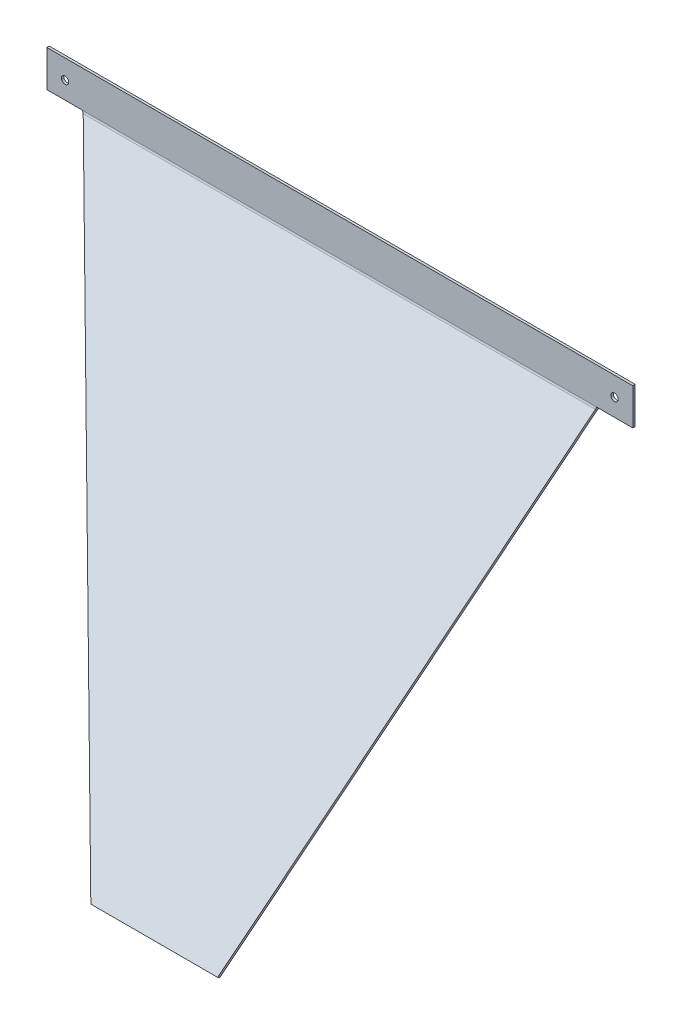
ISO-10303-21;
HEADER;
FILE_DESCRIPTION(('STEP AP214'),'2;1');
FILE_NAME('part.step','',(''),(''),'','','');
FILE_SCHEMA(('AUTOMOTIVE_DESIGN { 1 0 10303 214 1 1 1 1 }'));
ENDSEC;
DATA;
#1=APPLICATION_CONTEXT('core data for automotive mechanical design processes');
#2=APPLICATION_PROTOCOL_DEFINITION('international standard','automotive_design',2000,#1);
#3=PRODUCT_CONTEXT('',#1,'mechanical');
#4=PRODUCT('Part','Part','',(#3));
#5=PRODUCT_RELATED_PRODUCT_CATEGORY('part','',(#4));
#6=PRODUCT_DEFINITION_FORMATION('','',#4);
#7=PRODUCT_DEFINITION_CONTEXT('part definition',#1,'design');
#8=PRODUCT_DEFINITION('design','',#6,#7);
#9=PRODUCT_DEFINITION_SHAPE('','',#8);
#10=(LENGTH_UNIT() NAMED_UNIT(*) SI_UNIT(.MILLI.,.METRE.));
#11=(NAMED_UNIT(*) PLANE_ANGLE_UNIT() SI_UNIT($,.RADIAN.));
#12=(NAMED_UNIT(*) SI_UNIT($,.STERADIAN.) SOLID_ANGLE_UNIT());
#13=UNCERTAINTY_MEASURE_WITH_UNIT(LENGTH_MEASURE(1.E-05),#10,'distance_accuracy_value','');
#14=(GEOMETRIC_REPRESENTATION_CONTEXT(3) GLOBAL_UNCERTAINTY_ASSIGNED_CONTEXT((#13)) GLOBAL_UNIT_ASSIGNED_CONTEXT((#10,
#11,#12)) REPRESENTATION_CONTEXT('',''));
#15=CARTESIAN_POINT('',(0.,0.,0.));
#16=DIRECTION('',(0.,0.,1.));
#17=DIRECTION('',(1.,0.,0.));
#18=AXIS2_PLACEMENT_3D('',#15,#16,#17);
#19=CARTESIAN_POINT('',(-211.563590388948,1.0035352311325,-211.429668547693));
#20=DIRECTION('',(0.843991716803207,0.420919678305727,-0.332422331353624));
#21=DIRECTION('',(-0.536356208100154,0.662344756272809,-0.523088369083407));
#22=AXIS2_PLACEMENT_3D('',#19,#20,#21);
#23=PLANE('',#22);
#24=CARTESIAN_POINT('',(-210.036566425682,-2.12174038265548,-211.509971304452));
#25=CARTESIAN_POINT('',(-210.036566425682,-0.882182319065202,-209.940418563386));
#26=B_SPLINE_CURVE_WITH_KNOTS('',1,(#24,#25),.UNSPECIFIED.,.F.,.F.,(2,2),(0.,1.),.UNSPECIFIED.);
#27=CARTESIAN_POINT('',(-210.036566425682,-2.12174038265545,-211.509971304452));
#28=VERTEX_POINT('',#27);
#29=CARTESIAN_POINT('',(-210.036566425682,-0.882182319065228,-209.940418563386));
#30=VERTEX_POINT('',#29);
#31=EDGE_CURVE('E11',#28,#30,#26,.T.);
#32=ORIENTED_EDGE('',*,*,#31,.F.);
#33=DIRECTION('',(-0.536356208100154,0.662344756272809,-0.523088369083407));
#34=VECTOR('',#33,1.);
#35=CARTESIAN_POINT('',(-211.563590388948,-0.236022832457776,-212.999221288759));
#36=LINE('',#35,#34);
#37=CARTESIAN_POINT('',(42.7639640091258,-314.304396587156,35.0370345313996));
#38=VERTEX_POINT('',#37);
#39=EDGE_CURVE('E108',#38,#28,#36,.T.);
#40=ORIENTED_EDGE('',*,*,#39,.F.);
#41=DIRECTION('',(0.,0.619779031795136,0.784776370533086));
#42=VECTOR('',#41,1.);
#43=CARTESIAN_POINT('',(42.7639640091258,-313.064838523566,36.6065872724657));
#44=LINE('',#43,#42);
#45=CARTESIAN_POINT('',(42.7639640091258,-313.064838523566,36.6065872724657));
#46=VERTEX_POINT('',#45);
#47=EDGE_CURVE('E55',#38,#46,#44,.T.);
#48=ORIENTED_EDGE('',*,*,#47,.T.);
#49=DIRECTION('',(-0.536356208100154,0.662344756272809,-0.523088369083407));
#50=VECTOR('',#49,1.);
#51=CARTESIAN_POINT('',(-211.563590388948,1.0035352311325,-211.429668547693));
#52=LINE('',#51,#50);
#53=EDGE_CURVE('E111',#46,#30,#52,.T.);
#54=ORIENTED_EDGE('',*,*,#53,.T.);
#55=EDGE_LOOP('',(#32,#40,#48,#54));
#56=FACE_BOUND('',#55,.T.);
#57=ADVANCED_FACE('F43',(#56),#23,.F.);
#58=CARTESIAN_POINT('',(42.7639640091258,-313.064838523566,36.6065872724657));
#59=DIRECTION('',(0.,0.784776370533086,-0.619779031795136));
#60=DIRECTION('',(-1.,0.,0.));
#61=AXIS2_PLACEMENT_3D('',#58,#59,#60);
#62=PLANE('',#61);
#63=ORIENTED_EDGE('',*,*,#47,.F.);
#64=DIRECTION('',(1.,0.,0.));
#65=VECTOR('',#64,1.);
#66=CARTESIAN_POINT('',(0.,-314.304396587156,35.0370345313996));
#67=LINE('',#66,#65);
#68=CARTESIAN_POINT('',(146.869286468248,-314.304396587156,35.0370345313996));
#69=VERTEX_POINT('',#68);
#70=EDGE_CURVE('E143',#69,#38,#67,.F.);
#71=ORIENTED_EDGE('',*,*,#70,.F.);
#72=DIRECTION('',(0.,0.619779031795136,0.784776370533086));
#73=VECTOR('',#72,1.);
#74=CARTESIAN_POINT('',(146.869286468248,-313.064838523566,36.6065872724657));
#75=LINE('',#74,#73);
#76=CARTESIAN_POINT('',(146.869286468248,-313.064838523566,36.6065872724657));
#77=VERTEX_POINT('',#76);
#78=EDGE_CURVE('E193',#69,#77,#75,.T.);
#79=ORIENTED_EDGE('',*,*,#78,.T.);
#80=DIRECTION('',(-1.,0.,0.));
#81=VECTOR('',#80,1.);
#82=CARTESIAN_POINT('',(42.7639640091258,-313.064838523566,36.6065872724657));
#83=LINE('',#82,#81);
#84=EDGE_CURVE('E282',#77,#46,#83,.T.);
#85=ORIENTED_EDGE('',*,*,#84,.T.);
#86=EDGE_LOOP('',(#63,#71,#79,#85));
#87=FACE_BOUND('',#86,.T.);
#88=ADVANCED_FACE('F426',(#87),#62,.F.);
#89=CARTESIAN_POINT('',(146.869286468248,-313.064838523566,36.6065872724657));
#90=DIRECTION('',(-0.987492255733326,0.12373373912849,-0.0977190189676004));
#91=DIRECTION('',(-0.157667513669454,-0.77496058838393,0.612026994163596));
#92=AXIS2_PLACEMENT_3D('',#89,#90,#91);
#93=PLANE('',#92);
#94=ORIENTED_EDGE('',*,*,#78,.F.);
#95=DIRECTION('',(-0.157667513669454,-0.77496058838393,0.612026994163596));
#96=VECTOR('',#95,1.);
#97=CARTESIAN_POINT('',(146.869286468248,-314.304396587156,35.0370345313995));
#98=LINE('',#97,#96);
#99=CARTESIAN_POINT('',(210.383565713252,-2.12174038265539,-211.509971304452));
#100=VERTEX_POINT('',#99);
#101=EDGE_CURVE('E138',#100,#69,#98,.T.);
#102=ORIENTED_EDGE('',*,*,#101,.F.);
#103=CARTESIAN_POINT('',(210.383565713252,-0.882182319065137,-209.940418563386));
#104=CARTESIAN_POINT('',(210.383565713252,-2.12174038265542,-211.509971304452));
#105=B_SPLINE_CURVE_WITH_KNOTS('',1,(#103,#104),.UNSPECIFIED.,.F.,.F.,(2,2),(0.,1.),.UNSPECIFIED.);
#106=CARTESIAN_POINT('',(210.383565713252,-0.882182319065117,-209.940418563386));
#107=VERTEX_POINT('',#106);
#108=EDGE_CURVE('E196',#100,#107,#105,.F.);
#109=ORIENTED_EDGE('',*,*,#108,.T.);
#110=DIRECTION('',(-0.157667513669454,-0.77496058838393,0.612026994163596));
#111=VECTOR('',#110,1.);
#112=CARTESIAN_POINT('',(146.869286468248,-313.064838523566,36.6065872724657));
#113=LINE('',#112,#111);
#114=EDGE_CURVE('E273',#107,#77,#113,.T.);
#115=ORIENTED_EDGE('',*,*,#114,.T.);
#116=EDGE_LOOP('',(#94,#102,#109,#115));
#117=FACE_BOUND('',#116,.T.);
#118=ADVANCED_FACE('F215',(#117),#93,.F.);
#119=CARTESIAN_POINT('',(210.767219284903,0.724659156541195,-212.499997715965));
#120=CARTESIAN_POINT('',(210.703271087254,0.212889063114862,-212.499487724902));
#121=CARTESIAN_POINT('',(210.63933476102,-0.298594913490471,-212.412805020948));
#122=CARTESIAN_POINT('',(210.511450237136,-1.2652387865455,-212.076589759642));
#123=CARTESIAN_POINT('',(210.447513910902,-1.7201151067701,-211.827155834949));
#124=CARTESIAN_POINT('',(210.383565713252,-2.12174038265542,-211.509971304452));
#125=CARTESIAN_POINT('',(210.767219284903,0.726652203089471,-210.499998709023));
#126=CARTESIAN_POINT('',(210.703271275476,0.437391697335336,-210.499710454054));
#127=CARTESIAN_POINT('',(210.63933476102,0.148291206984618,-210.450715881405));
#128=CARTESIAN_POINT('',(210.511450237136,-0.398072721263876,-210.260681168493));
#129=CARTESIAN_POINT('',(210.447513722679,-0.65517739650625,-210.119696248596));
#130=CARTESIAN_POINT('',(210.383565713252,-0.882182319065137,-209.940418563386));
#131=B_SPLINE_SURFACE_WITH_KNOTS('',1,3,((#119,#120,#121,#122,#123,#124),(#125,#126,#127,#128,
#129,#130)),.UNSPECIFIED.,.F.,.F.,.F.,(2,2),(4,2,4),(0.,1.),(0.,0.5,1.),.UNSPECIFIED.);
#132=CARTESIAN_POINT('',(210.383565713252,-2.12174038265542,-211.509971304452));
#133=CARTESIAN_POINT('',(210.447513910902,-1.7201151067701,-211.827155834949));
#134=CARTESIAN_POINT('',(210.511450237136,-1.2652387865455,-212.076589759642));
#135=CARTESIAN_POINT('',(210.63933476102,-0.298594913490471,-212.412805020948));
#136=CARTESIAN_POINT('',(210.703271087254,0.212889063114862,-212.499487724902));
#137=CARTESIAN_POINT('',(210.767219284903,0.724659156541195,-212.499997715965));
#138=B_SPLINE_CURVE_WITH_KNOTS('',3,(#132,#133,#134,#135,#136,#137),.UNSPECIFIED.,.F.,.F.,(4,2,
4),(0.,0.5,1.),.UNSPECIFIED.);
#139=CARTESIAN_POINT('',(210.767219284903,0.724659156541195,-212.499997715965));
#140=VERTEX_POINT('',#139);
#141=EDGE_CURVE('E132',#140,#100,#138,.F.);
#142=CARTESIAN_POINT('',(210.767219284903,0.724659156541195,-212.499997715965));
#143=CARTESIAN_POINT('',(210.767219284903,0.726652203089471,-210.499998709023));
#144=B_SPLINE_CURVE_WITH_KNOTS('',1,(#142,#143),.UNSPECIFIED.,.F.,.F.,(2,2),(0.,1.),.UNSPECIFIED.);
#145=CARTESIAN_POINT('',(210.767219284903,0.726652203089428,-210.499998709023));
#146=VERTEX_POINT('',#145);
#147=EDGE_CURVE('E252',#140,#146,#144,.T.);
#148=CARTESIAN_POINT('',(210.767219284903,0.726652203089471,-210.499998709023));
#149=CARTESIAN_POINT('',(210.703271275476,0.437391697335336,-210.499710454054));
#150=CARTESIAN_POINT('',(210.63933476102,0.148291206984618,-210.450715881405));
#151=CARTESIAN_POINT('',(210.511450237136,-0.398072721263876,-210.260681168493));
#152=CARTESIAN_POINT('',(210.447513722679,-0.65517739650625,-210.119696248596));
#153=CARTESIAN_POINT('',(210.383565713252,-0.882182319065137,-209.940418563386));
#154=B_SPLINE_CURVE_WITH_KNOTS('',3,(#148,#149,#150,#151,#152,#153),.UNSPECIFIED.,.F.,.F.,(4,2,
4),(0.,0.5,1.),.UNSPECIFIED.);
#155=EDGE_CURVE('E287',#146,#107,#154,.T.);
#156=ORIENTED_EDGE('',*,*,#108,.F.);
#157=ORIENTED_EDGE('',*,*,#141,.F.);
#158=ORIENTED_EDGE('',*,*,#147,.T.);
#159=ORIENTED_EDGE('',*,*,#155,.T.);
#160=EDGE_LOOP('',(#156,#157,#158,#159));
#161=FACE_BOUND('',#160,.T.);
#162=ADVANCED_FACE('F202',(#161),#131,.T.);
#163=CARTESIAN_POINT('',(225.633609642452,0.726652203089427,-210.499998709023));
#164=DIRECTION('',(0.,0.999999503470559,-0.00099652327415575));
#165=DIRECTION('',(1.,0.,0.));
#166=AXIS2_PLACEMENT_3D('',#163,#164,#165);
#167=PLANE('',#166);
#168=ORIENTED_EDGE('',*,*,#147,.F.);
#169=DIRECTION('',(1.,0.,0.));
#170=VECTOR('',#169,1.);
#171=CARTESIAN_POINT('',(-480.84641141443,0.724659156541006,-212.499997715964));
#172=LINE('',#171,#170);
#173=CARTESIAN_POINT('',(240.5,0.724659156541118,-212.499997715965));
#174=VERTEX_POINT('',#173);
#175=EDGE_CURVE('E374',#174,#140,#172,.F.);
#176=ORIENTED_EDGE('',*,*,#175,.F.);
#177=DIRECTION('',(0.,0.00099652327415625,0.999999503470559));
#178=VECTOR('',#177,1.);
#179=CARTESIAN_POINT('',(240.5,0.726652203089428,-210.499998709023));
#180=LINE('',#179,#178);
#181=CARTESIAN_POINT('',(240.5,0.726652203089428,-210.499998709023));
#182=VERTEX_POINT('',#181);
#183=EDGE_CURVE('E487',#174,#182,#180,.T.);
#184=ORIENTED_EDGE('',*,*,#183,.T.);
#185=DIRECTION('',(1.,0.,0.));
#186=VECTOR('',#185,1.);
#187=CARTESIAN_POINT('',(-480.84641141443,0.726652203089317,-210.499998709023));
#188=LINE('',#187,#186);
#189=EDGE_CURVE('E292',#182,#146,#188,.F.);
#190=ORIENTED_EDGE('',*,*,#189,.T.);
#191=EDGE_LOOP('',(#168,#176,#184,#190));
#192=FACE_BOUND('',#191,.T.);
#193=ADVANCED_FACE('F214',(#192),#167,.F.);
#194=CARTESIAN_POINT('',(240.5,0.729243163602233,-207.9));
#195=DIRECTION('',(-1.,0.,0.));
#196=DIRECTION('',(0.,-1.,0.));
#197=AXIS2_PLACEMENT_3D('',#194,#195,#196);
#198=PLANE('',#197);
#199=ORIENTED_EDGE('',*,*,#183,.F.);
#200=CARTESIAN_POINT('',(240.5,0.729243163602235,-207.9));
#201=DIRECTION('',(1.,0.,0.));
#202=DIRECTION('',(0.,1.,0.));
#203=AXIS2_PLACEMENT_3D('',#200,#201,#202);
#204=CIRCLE('',#203,4.6);
#205=CARTESIAN_POINT('',(240.5,0.729243163602223,-212.5));
#206=VERTEX_POINT('',#205);
#207=EDGE_CURVE('E360',#206,#174,#204,.F.);
#208=ORIENTED_EDGE('',*,*,#207,.F.);
#209=DIRECTION('',(0.,0.,1.));
#210=VECTOR('',#209,1.);
#211=CARTESIAN_POINT('',(240.5,0.729243163602233,-210.5));
#212=LINE('',#211,#210);
#213=CARTESIAN_POINT('',(240.5,0.729243163602233,-210.5));
#214=VERTEX_POINT('',#213);
#215=EDGE_CURVE('E481',#206,#214,#212,.T.);
#216=ORIENTED_EDGE('',*,*,#215,.T.);
#217=CARTESIAN_POINT('',(240.5,0.729243163602233,-207.9));
#218=DIRECTION('',(1.,0.,0.));
#219=DIRECTION('',(0.,1.,0.));
#220=AXIS2_PLACEMENT_3D('',#217,#218,#219);
#221=CIRCLE('',#220,2.6);
#222=EDGE_CURVE('E342',#214,#182,#221,.F.);
#223=ORIENTED_EDGE('',*,*,#222,.T.);
#224=EDGE_LOOP('',(#199,#208,#216,#223));
#225=FACE_BOUND('',#224,.T.);
#226=ADVANCED_FACE('F483',(#225),#198,.F.);
#227=CARTESIAN_POINT('',(240.5,0.72565567922156,-210.5));
#228=DIRECTION('',(-1.,0.,0.));
#229=DIRECTION('',(0.,-1.,0.));
#230=AXIS2_PLACEMENT_3D('',#227,#228,#229);
#231=PLANE('',#230);
#232=ORIENTED_EDGE('',*,*,#215,.F.);
#233=DIRECTION('',(0.,-1.,0.));
#234=VECTOR('',#233,1.);
#235=CARTESIAN_POINT('',(240.5,-131.101570322424,-212.500000000001));
#236=LINE('',#235,#234);
#237=CARTESIAN_POINT('',(240.5,30.7256556792215,-212.5));
#238=VERTEX_POINT('',#237);
#239=EDGE_CURVE('E355',#238,#206,#236,.T.);
#240=ORIENTED_EDGE('',*,*,#239,.F.);
#241=DIRECTION('',(0.,0.,1.));
#242=VECTOR('',#241,1.);
#243=CARTESIAN_POINT('',(240.5,30.7256556792215,-210.5));
#244=LINE('',#243,#242);
#245=CARTESIAN_POINT('',(240.5,30.7256556792215,-210.5));
#246=VERTEX_POINT('',#245);
#247=EDGE_CURVE('E488',#238,#246,#244,.T.);
#248=ORIENTED_EDGE('',*,*,#247,.T.);
#249=DIRECTION('',(0.,-1.,0.));
#250=VECTOR('',#249,1.);
#251=CARTESIAN_POINT('',(240.5,0.72565567922156,-210.5));
#252=LINE('',#251,#250);
#253=EDGE_CURVE('E323',#246,#214,#252,.T.);
#254=ORIENTED_EDGE('',*,*,#253,.T.);
#255=EDGE_LOOP('',(#232,#240,#248,#254));
#256=FACE_BOUND('',#255,.T.);
#257=ADVANCED_FACE('F493',(#256),#231,.F.);
#258=CARTESIAN_POINT('',(240.5,30.7256556792215,-210.5));
#259=DIRECTION('',(0.,-1.,0.));
#260=DIRECTION('',(1.,0.,0.));
#261=AXIS2_PLACEMENT_3D('',#258,#259,#260);
#262=PLANE('',#261);
#263=ORIENTED_EDGE('',*,*,#247,.F.);
#264=DIRECTION('',(1.,0.,0.));
#265=VECTOR('',#264,1.);
#266=CARTESIAN_POINT('',(0.,30.7256556792216,-212.5));
#267=LINE('',#266,#265);
#268=CARTESIAN_POINT('',(-240.5,30.7256556792216,-212.5));
#269=VERTEX_POINT('',#268);
#270=EDGE_CURVE('E365',#269,#238,#267,.T.);
#271=ORIENTED_EDGE('',*,*,#270,.F.);
#272=DIRECTION('',(0.,0.,1.));
#273=VECTOR('',#272,1.);
#274=CARTESIAN_POINT('',(-240.5,30.7256556792216,-210.5));
#275=LINE('',#274,#273);
#276=CARTESIAN_POINT('',(-240.5,30.7256556792216,-210.5));
#277=VERTEX_POINT('',#276);
#278=EDGE_CURVE('E507',#269,#277,#275,.T.);
#279=ORIENTED_EDGE('',*,*,#278,.T.);
#280=DIRECTION('',(1.,0.,0.));
#281=VECTOR('',#280,1.);
#282=CARTESIAN_POINT('',(240.5,30.7256556792215,-210.5));
#283=LINE('',#282,#281);
#284=EDGE_CURVE('E327',#277,#246,#283,.T.);
#285=ORIENTED_EDGE('',*,*,#284,.T.);
#286=EDGE_LOOP('',(#263,#271,#279,#285));
#287=FACE_BOUND('',#286,.T.);
#288=ADVANCED_FACE('F506',(#287),#262,.F.);
#289=CARTESIAN_POINT('',(-240.5,30.7256556792216,-210.5));
#290=DIRECTION('',(1.,0.,0.));
#291=DIRECTION('',(0.,1.,0.));
#292=AXIS2_PLACEMENT_3D('',#289,#290,#291);
#293=PLANE('',#292);
#294=ORIENTED_EDGE('',*,*,#278,.F.);
#295=DIRECTION('',(0.,-1.,0.));
#296=VECTOR('',#295,1.);
#297=CARTESIAN_POINT('',(-240.5,-131.101570322424,-212.500000000001));
#298=LINE('',#297,#296);
#299=CARTESIAN_POINT('',(-240.5,0.729243163602094,-212.5));
#300=VERTEX_POINT('',#299);
#301=EDGE_CURVE('E361',#300,#269,#298,.F.);
#302=ORIENTED_EDGE('',*,*,#301,.F.);
#303=DIRECTION('',(0.,0.,1.));
#304=VECTOR('',#303,1.);
#305=CARTESIAN_POINT('',(-240.5,0.729243163602122,-210.5));
#306=LINE('',#305,#304);
#307=CARTESIAN_POINT('',(-240.5,0.729243163602122,-210.5));
#308=VERTEX_POINT('',#307);
#309=EDGE_CURVE('E500',#300,#308,#306,.T.);
#310=ORIENTED_EDGE('',*,*,#309,.T.);
#311=DIRECTION('',(0.,1.,0.));
#312=VECTOR('',#311,1.);
#313=CARTESIAN_POINT('',(-240.5,30.7256556792216,-210.5));
#314=LINE('',#313,#312);
#315=EDGE_CURVE('E331',#308,#277,#314,.T.);
#316=ORIENTED_EDGE('',*,*,#315,.T.);
#317=EDGE_LOOP('',(#294,#302,#310,#316));
#318=FACE_BOUND('',#317,.T.);
#319=ADVANCED_FACE('F559',(#318),#293,.F.);
#320=CARTESIAN_POINT('',(-240.5,0.729243163602122,-207.9));
#321=DIRECTION('',(-1.,0.,0.));
#322=DIRECTION('',(0.,-1.,0.));
#323=AXIS2_PLACEMENT_3D('',#320,#321,#322);
#324=PLANE('',#323);
#325=ORIENTED_EDGE('',*,*,#309,.F.);
#326=CARTESIAN_POINT('',(-240.5,0.72924316360216,-207.9));
#327=DIRECTION('',(1.,0.,0.));
#328=DIRECTION('',(0.,1.,0.));
#329=AXIS2_PLACEMENT_3D('',#326,#327,#328);
#330=CIRCLE('',#329,4.6);
#331=CARTESIAN_POINT('',(-240.5,0.724659156541239,-212.499997715965));
#332=VERTEX_POINT('',#331);
#333=EDGE_CURVE('E284',#332,#300,#330,.T.);
#334=ORIENTED_EDGE('',*,*,#333,.F.);
#335=DIRECTION('',(0.,0.000996523274127443,0.999999503470559));
#336=VECTOR('',#335,1.);
#337=CARTESIAN_POINT('',(-240.5,0.726652203089428,-210.499998709023));
#338=LINE('',#337,#336);
#339=CARTESIAN_POINT('',(-240.5,0.726652203089428,-210.499998709023));
#340=VERTEX_POINT('',#339);
#341=EDGE_CURVE('E63',#332,#340,#338,.T.);
#342=ORIENTED_EDGE('',*,*,#341,.T.);
#343=CARTESIAN_POINT('',(-240.5,0.729243163602122,-207.9));
#344=DIRECTION('',(1.,0.,0.));
#345=DIRECTION('',(0.,1.,0.));
#346=AXIS2_PLACEMENT_3D('',#343,#344,#345);
#347=CIRCLE('',#346,2.6);
#348=EDGE_CURVE('E348',#340,#308,#347,.T.);
#349=ORIENTED_EDGE('',*,*,#348,.T.);
#350=EDGE_LOOP('',(#325,#334,#342,#349));
#351=FACE_BOUND('',#350,.T.);
#352=ADVANCED_FACE('F499',(#351),#324,.T.);
#353=CARTESIAN_POINT('',(-226.031795194474,0.726652203089468,-210.499998709023));
#354=DIRECTION('',(0.,0.999999503470559,-0.000996523274113049));
#355=DIRECTION('',(1.,0.,0.));
#356=AXIS2_PLACEMENT_3D('',#353,#354,#355);
#357=PLANE('',#356);
#358=ORIENTED_EDGE('',*,*,#341,.F.);
#359=DIRECTION('',(1.,0.,0.));
#360=VECTOR('',#359,1.);
#361=CARTESIAN_POINT('',(-480.84641141443,0.724659156541202,-212.499997715964));
#362=LINE('',#361,#360);
#363=CARTESIAN_POINT('',(-211.563590388948,0.724659156541244,-212.499997715965));
#364=VERTEX_POINT('',#363);
#365=EDGE_CURVE('E152',#364,#332,#362,.F.);
#366=ORIENTED_EDGE('',*,*,#365,.F.);
#367=CARTESIAN_POINT('',(-211.563590388948,0.726652203089465,-210.499998709023));
#368=CARTESIAN_POINT('',(-211.563590388948,0.724659156541235,-212.499997715965));
#369=B_SPLINE_CURVE_WITH_KNOTS('',1,(#367,#368),.UNSPECIFIED.,.F.,.F.,(2,2),(0.,1.),.UNSPECIFIED.);
#370=CARTESIAN_POINT('',(-211.563590388948,0.726652203089428,-210.499998709023));
#371=VERTEX_POINT('',#370);
#372=EDGE_CURVE('E150',#364,#371,#369,.F.);
#373=ORIENTED_EDGE('',*,*,#372,.T.);
#374=DIRECTION('',(1.,0.,0.));
#375=VECTOR('',#374,1.);
#376=CARTESIAN_POINT('',(-480.84641141443,0.726652203089428,-210.499998709023));
#377=LINE('',#376,#375);
#378=EDGE_CURVE('E335',#371,#340,#377,.F.);
#379=ORIENTED_EDGE('',*,*,#378,.T.);
#380=EDGE_LOOP('',(#358,#366,#373,#379));
#381=FACE_BOUND('',#380,.T.);
#382=ADVANCED_FACE('F501',(#381),#357,.F.);
#383=CARTESIAN_POINT('',(-225.5,15.,-210.5));
#384=DIRECTION('',(0.,0.,1.));
#385=DIRECTION('',(0.,-1.,0.));
#386=AXIS2_PLACEMENT_3D('',#383,#384,#385);
#387=CYLINDRICAL_SURFACE('',#386,2.99999999999999);
#388=CARTESIAN_POINT('',(-225.5,15.,-210.5));
#389=DIRECTION('',(0.,0.,1.));
#390=DIRECTION('',(0.,-1.,0.));
#391=AXIS2_PLACEMENT_3D('',#388,#389,#390);
#392=CIRCLE('',#391,2.99999999999999);
#393=CARTESIAN_POINT('',(-225.5,12.,-210.5));
#394=VERTEX_POINT('',#393);
#395=EDGE_CURVE('E311',#394,#394,#392,.T.);
#396=ORIENTED_EDGE('',*,*,#395,.T.);
#397=EDGE_LOOP('',(#396));
#398=FACE_BOUND('',#397,.T.);
#399=CARTESIAN_POINT('',(-225.5,15.,-212.5));
#400=DIRECTION('',(0.,0.,1.));
#401=DIRECTION('',(0.,-1.,0.));
#402=AXIS2_PLACEMENT_3D('',#399,#400,#401);
#403=CIRCLE('',#402,2.99999999999999);
#404=CARTESIAN_POINT('',(-225.5,12.,-212.5));
#405=VERTEX_POINT('',#404);
#406=EDGE_CURVE('E398',#405,#405,#403,.T.);
#407=ORIENTED_EDGE('',*,*,#406,.F.);
#408=EDGE_LOOP('',(#407));
#409=FACE_BOUND('',#408,.T.);
#410=ADVANCED_FACE('F175',(#398,#409),#387,.F.);
#411=CARTESIAN_POINT('',(225.5,15.,-210.5));
#412=DIRECTION('',(0.,0.,1.));
#413=DIRECTION('',(0.,-1.,0.));
#414=AXIS2_PLACEMENT_3D('',#411,#412,#413);
#415=CYLINDRICAL_SURFACE('',#414,2.99999999999999);
#416=CARTESIAN_POINT('',(225.5,15.,-210.5));
#417=DIRECTION('',(0.,0.,1.));
#418=DIRECTION('',(0.,-1.,0.));
#419=AXIS2_PLACEMENT_3D('',#416,#417,#418);
#420=CIRCLE('',#419,2.99999999999999);
#421=CARTESIAN_POINT('',(225.5,12.,-210.5));
#422=VERTEX_POINT('',#421);
#423=EDGE_CURVE('E315',#422,#422,#420,.T.);
#424=ORIENTED_EDGE('',*,*,#423,.T.);
#425=EDGE_LOOP('',(#424));
#426=FACE_BOUND('',#425,.T.);
#427=CARTESIAN_POINT('',(225.5,15.,-212.5));
#428=DIRECTION('',(0.,0.,1.));
#429=DIRECTION('',(0.,-1.,0.));
#430=AXIS2_PLACEMENT_3D('',#427,#428,#429);
#431=CIRCLE('',#430,2.99999999999999);
#432=CARTESIAN_POINT('',(225.5,12.,-212.5));
#433=VERTEX_POINT('',#432);
#434=EDGE_CURVE('E356',#433,#433,#431,.T.);
#435=ORIENTED_EDGE('',*,*,#434,.F.);
#436=EDGE_LOOP('',(#435));
#437=FACE_BOUND('',#436,.T.);
#438=ADVANCED_FACE('F45',(#426,#437),#415,.F.);
#439=CARTESIAN_POINT('',(-210.036566425682,-2.12174038265548,-211.509971304452));
#440=CARTESIAN_POINT('',(-210.291089655695,-1.72012203269245,-211.827150365185));
#441=CARTESIAN_POINT('',(-210.545574413438,-1.26523878654553,-212.076589759642));
#442=CARTESIAN_POINT('',(-211.054582401193,-0.298594913490464,-212.412805020948));
#443=CARTESIAN_POINT('',(-211.309067158936,0.212897888455457,-212.499487733697));
#444=CARTESIAN_POINT('',(-211.563590388948,0.724659156541235,-212.499997715965));
#445=CARTESIAN_POINT('',(-210.036566425682,-0.882182319065202,-209.940418563386));
#446=CARTESIAN_POINT('',(-210.291083943077,-0.655185737912617,-210.11968966095));
#447=CARTESIAN_POINT('',(-210.545574413438,-0.398072721263924,-210.260681168493));
#448=CARTESIAN_POINT('',(-211.054582401193,0.148291206984591,-210.450715881405));
#449=CARTESIAN_POINT('',(-211.309072871553,0.437402326353409,-210.499710464646));
#450=CARTESIAN_POINT('',(-211.563590388948,0.726652203089465,-210.499998709023));
#451=B_SPLINE_SURFACE_WITH_KNOTS('',1,3,((#439,#440,#441,#442,#443,#444),(#445,#446,#447,#448,
#449,#450)),.UNSPECIFIED.,.F.,.F.,.F.,(2,2),(4,2,4),(0.,1.),(0.,0.5,1.),.UNSPECIFIED.);
#452=CARTESIAN_POINT('',(-211.563590388948,0.724659156541235,-212.499997715965));
#453=CARTESIAN_POINT('',(-211.309067158936,0.212897888455457,-212.499487733697));
#454=CARTESIAN_POINT('',(-211.054582401193,-0.298594913490464,-212.412805020948));
#455=CARTESIAN_POINT('',(-210.545574413438,-1.26523878654553,-212.076589759642));
#456=CARTESIAN_POINT('',(-210.291089655695,-1.72012203269245,-211.827150365185));
#457=CARTESIAN_POINT('',(-210.036566425682,-2.12174038265548,-211.509971304452));
#458=B_SPLINE_CURVE_WITH_KNOTS('',3,(#452,#453,#454,#455,#456,#457),.UNSPECIFIED.,.F.,.F.,(4,2,
4),(0.,0.5,1.),.UNSPECIFIED.);
#459=EDGE_CURVE('E127',#28,#364,#458,.F.);
#460=CARTESIAN_POINT('',(-210.036566425682,-0.882182319065202,-209.940418563386));
#461=CARTESIAN_POINT('',(-210.291083943077,-0.655185737912617,-210.11968966095));
#462=CARTESIAN_POINT('',(-210.545574413438,-0.398072721263924,-210.260681168493));
#463=CARTESIAN_POINT('',(-211.054582401193,0.148291206984591,-210.450715881405));
#464=CARTESIAN_POINT('',(-211.309072871553,0.437402326353409,-210.499710464646));
#465=CARTESIAN_POINT('',(-211.563590388948,0.726652203089465,-210.499998709023));
#466=B_SPLINE_CURVE_WITH_KNOTS('',3,(#460,#461,#462,#463,#464,#465),.UNSPECIFIED.,.F.,.F.,(4,2,
4),(0.,0.5,1.),.UNSPECIFIED.);
#467=EDGE_CURVE('E293',#30,#371,#466,.T.);
#468=ORIENTED_EDGE('',*,*,#459,.F.);
#469=ORIENTED_EDGE('',*,*,#31,.T.);
#470=ORIENTED_EDGE('',*,*,#467,.T.);
#471=ORIENTED_EDGE('',*,*,#372,.F.);
#472=EDGE_LOOP('',(#468,#469,#470,#471));
#473=FACE_BOUND('',#472,.T.);
#474=ADVANCED_FACE('F148',(#473),#451,.T.);
#475=CARTESIAN_POINT('',(-480.84641141443,0.729243163602122,-207.9));
#476=DIRECTION('',(1.,0.,0.));
#477=DIRECTION('',(0.,1.,0.));
#478=AXIS2_PLACEMENT_3D('',#475,#476,#477);
#479=CYLINDRICAL_SURFACE('',#478,2.6);
#480=ORIENTED_EDGE('',*,*,#378,.F.);
#481=ORIENTED_EDGE('',*,*,#467,.F.);
#482=DIRECTION('',(-1.,0.,0.));
#483=VECTOR('',#482,1.);
#484=CARTESIAN_POINT('',(0.,-0.882182319065228,-209.940418563386));
#485=LINE('',#484,#483);
#486=EDGE_CURVE('E280',#107,#30,#485,.T.);
#487=ORIENTED_EDGE('',*,*,#486,.F.);
#488=ORIENTED_EDGE('',*,*,#155,.F.);
#489=ORIENTED_EDGE('',*,*,#189,.F.);
#490=ORIENTED_EDGE('',*,*,#222,.F.);
#491=DIRECTION('',(-1.,0.,0.));
#492=VECTOR('',#491,1.);
#493=CARTESIAN_POINT('',(0.,0.729243163602122,-210.5));
#494=LINE('',#493,#492);
#495=EDGE_CURVE('E319',#214,#308,#494,.T.);
#496=ORIENTED_EDGE('',*,*,#495,.T.);
#497=ORIENTED_EDGE('',*,*,#348,.F.);
#498=EDGE_LOOP('',(#480,#481,#487,#488,#489,#490,#496,#497));
#499=FACE_BOUND('',#498,.T.);
#500=ADVANCED_FACE('F172',(#499),#479,.F.);
#501=CARTESIAN_POINT('',(0.,-131.101570322424,-210.500000000001));
#502=DIRECTION('',(0.,0.,1.));
#503=DIRECTION('',(0.,-1.,0.));
#504=AXIS2_PLACEMENT_3D('',#501,#502,#503);
#505=PLANE('',#504);
#506=ORIENTED_EDGE('',*,*,#395,.F.);
#507=EDGE_LOOP('',(#506));
#508=FACE_BOUND('',#507,.T.);
#509=ORIENTED_EDGE('',*,*,#423,.F.);
#510=EDGE_LOOP('',(#509));
#511=FACE_BOUND('',#510,.T.);
#512=ORIENTED_EDGE('',*,*,#495,.F.);
#513=ORIENTED_EDGE('',*,*,#253,.F.);
#514=ORIENTED_EDGE('',*,*,#284,.F.);
#515=ORIENTED_EDGE('',*,*,#315,.F.);
#516=EDGE_LOOP('',(#512,#513,#514,#515));
#517=FACE_BOUND('',#516,.T.);
#518=ADVANCED_FACE('F497',(#508,#511,#517),#505,.T.);
#519=CARTESIAN_POINT('',(0.,-102.451356727884,-129.725918052154));
#520=DIRECTION('',(0.,0.619779031795136,0.784776370533086));
#521=DIRECTION('',(0.,-0.784776370533086,0.619779031795136));
#522=AXIS2_PLACEMENT_3D('',#519,#520,#521);
#523=PLANE('',#522);
#524=ORIENTED_EDGE('',*,*,#114,.F.);
#525=ORIENTED_EDGE('',*,*,#486,.T.);
#526=ORIENTED_EDGE('',*,*,#53,.F.);
#527=ORIENTED_EDGE('',*,*,#84,.F.);
#528=EDGE_LOOP('',(#524,#525,#526,#527));
#529=FACE_BOUND('',#528,.T.);
#530=ADVANCED_FACE('F278',(#529),#523,.T.);
#531=CARTESIAN_POINT('',(-480.84641141443,0.729243163602122,-207.9));
#532=DIRECTION('',(1.,0.,0.));
#533=DIRECTION('',(0.,1.,0.));
#534=AXIS2_PLACEMENT_3D('',#531,#532,#533);
#535=CYLINDRICAL_SURFACE('',#534,4.6);
#536=ORIENTED_EDGE('',*,*,#365,.T.);
#537=ORIENTED_EDGE('',*,*,#333,.T.);
#538=DIRECTION('',(1.,0.,0.));
#539=VECTOR('',#538,1.);
#540=CARTESIAN_POINT('',(-480.84641141443,0.729243163601991,-212.5));
#541=LINE('',#540,#539);
#542=EDGE_CURVE('E351',#206,#300,#541,.F.);
#543=ORIENTED_EDGE('',*,*,#542,.F.);
#544=ORIENTED_EDGE('',*,*,#207,.T.);
#545=ORIENTED_EDGE('',*,*,#175,.T.);
#546=ORIENTED_EDGE('',*,*,#141,.T.);
#547=DIRECTION('',(1.,0.,0.));
#548=VECTOR('',#547,1.);
#549=CARTESIAN_POINT('',(0.,-2.12174038265539,-211.509971304452));
#550=LINE('',#549,#548);
#551=EDGE_CURVE('E124',#100,#28,#550,.F.);
#552=ORIENTED_EDGE('',*,*,#551,.T.);
#553=ORIENTED_EDGE('',*,*,#459,.T.);
#554=EDGE_LOOP('',(#536,#537,#543,#544,#545,#546,#552,#553));
#555=FACE_BOUND('',#554,.T.);
#556=ADVANCED_FACE('F126',(#555),#535,.T.);
#557=CARTESIAN_POINT('',(0.,-131.101570322424,-212.500000000001));
#558=DIRECTION('',(0.,0.,1.));
#559=DIRECTION('',(0.,-1.,0.));
#560=AXIS2_PLACEMENT_3D('',#557,#558,#559);
#561=PLANE('',#560);
#562=ORIENTED_EDGE('',*,*,#406,.T.);
#563=EDGE_LOOP('',(#562));
#564=FACE_BOUND('',#563,.T.);
#565=ORIENTED_EDGE('',*,*,#434,.T.);
#566=EDGE_LOOP('',(#565));
#567=FACE_BOUND('',#566,.T.);
#568=ORIENTED_EDGE('',*,*,#542,.T.);
#569=ORIENTED_EDGE('',*,*,#301,.T.);
#570=ORIENTED_EDGE('',*,*,#270,.T.);
#571=ORIENTED_EDGE('',*,*,#239,.T.);
#572=EDGE_LOOP('',(#568,#569,#570,#571));
#573=FACE_BOUND('',#572,.T.);
#574=ADVANCED_FACE('F389',(#564,#567,#573),#561,.F.);
#575=CARTESIAN_POINT('',(0.,-103.690914791474,-131.29547079322));
#576=DIRECTION('',(0.,0.619779031795136,0.784776370533086));
#577=DIRECTION('',(0.,-0.784776370533086,0.619779031795136));
#578=AXIS2_PLACEMENT_3D('',#575,#576,#577);
#579=PLANE('',#578);
#580=ORIENTED_EDGE('',*,*,#101,.T.);
#581=ORIENTED_EDGE('',*,*,#70,.T.);
#582=ORIENTED_EDGE('',*,*,#39,.T.);
#583=ORIENTED_EDGE('',*,*,#551,.F.);
#584=EDGE_LOOP('',(#580,#581,#582,#583));
#585=FACE_BOUND('',#584,.T.);
#586=ADVANCED_FACE('F141',(#585),#579,.F.);
#587=CLOSED_SHELL('',(#57,#88,#118,#162,#193,#226,#257,#288,#319,#352,#382,#410,#438,#474,#500,
#518,#530,#556,#574,#586));
#588=MANIFOLD_SOLID_BREP('B2',#587);
#589=ADVANCED_BREP_SHAPE_REPRESENTATION('',(#18,#588),#14);
#590=SHAPE_DEFINITION_REPRESENTATION(#9,#589);
ENDSEC;
END-ISO-10303-21;
